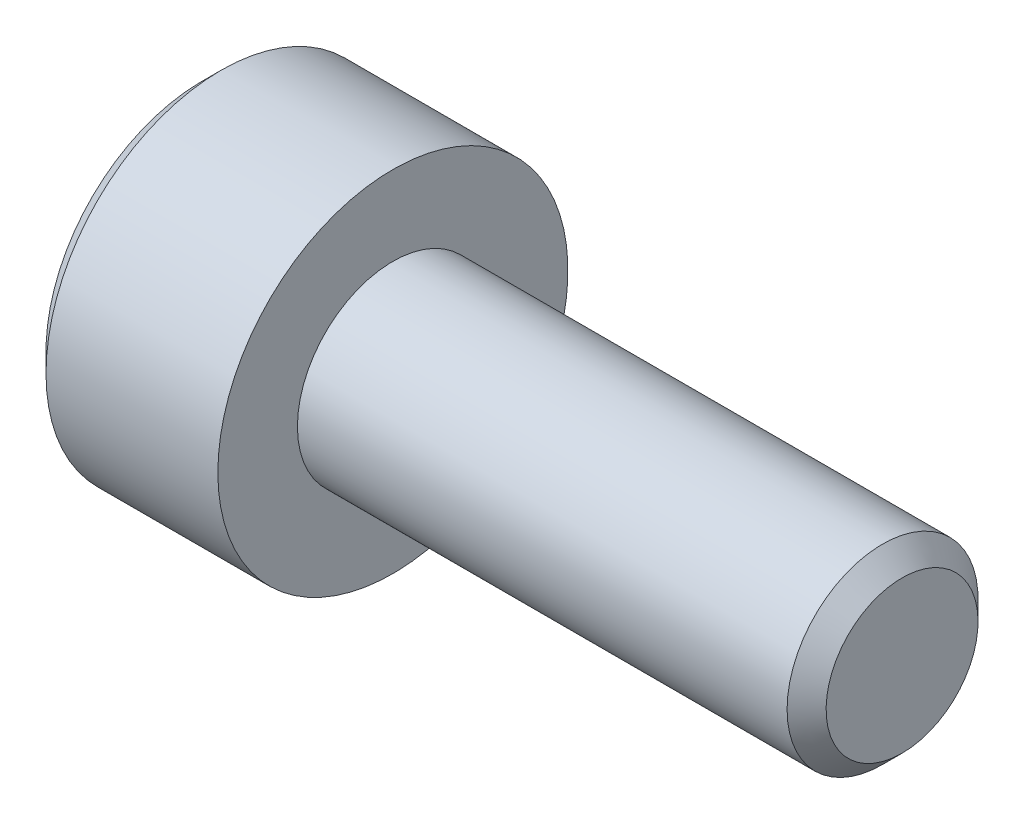
ISO-10303-21;
HEADER;
FILE_DESCRIPTION(('STEP AP214'),'2;1');
FILE_NAME('part.step','',(''),(''),'','','');
FILE_SCHEMA(('AUTOMOTIVE_DESIGN { 1 0 10303 214 1 1 1 1 }'));
ENDSEC;
DATA;
#1=APPLICATION_CONTEXT('core data for automotive mechanical design processes');
#2=APPLICATION_PROTOCOL_DEFINITION('international standard','automotive_design',2000,#1);
#3=PRODUCT_CONTEXT('',#1,'mechanical');
#4=PRODUCT('Part','Part','',(#3));
#5=PRODUCT_RELATED_PRODUCT_CATEGORY('part','',(#4));
#6=PRODUCT_DEFINITION_FORMATION('','',#4);
#7=PRODUCT_DEFINITION_CONTEXT('part definition',#1,'design');
#8=PRODUCT_DEFINITION('design','',#6,#7);
#9=PRODUCT_DEFINITION_SHAPE('','',#8);
#10=(LENGTH_UNIT() NAMED_UNIT(*) SI_UNIT(.MILLI.,.METRE.));
#11=(NAMED_UNIT(*) PLANE_ANGLE_UNIT() SI_UNIT($,.RADIAN.));
#12=(NAMED_UNIT(*) SI_UNIT($,.STERADIAN.) SOLID_ANGLE_UNIT());
#13=UNCERTAINTY_MEASURE_WITH_UNIT(LENGTH_MEASURE(1.E-05),#10,'distance_accuracy_value','');
#14=(GEOMETRIC_REPRESENTATION_CONTEXT(3) GLOBAL_UNCERTAINTY_ASSIGNED_CONTEXT((#13)) GLOBAL_UNIT_ASSIGNED_CONTEXT((#10,
#11,#12)) REPRESENTATION_CONTEXT('',''));
#15=CARTESIAN_POINT('',(0.,0.,0.));
#16=DIRECTION('',(0.,0.,1.));
#17=DIRECTION('',(1.,0.,0.));
#18=AXIS2_PLACEMENT_3D('',#15,#16,#17);
#19=CARTESIAN_POINT('',(-1.49999999999295,0.,0.));
#20=DIRECTION('',(-1.,0.,0.));
#21=DIRECTION('',(0.,0.,1.));
#22=AXIS2_PLACEMENT_3D('',#19,#20,#21);
#23=CONICAL_SURFACE('',#22,1.24999999997044,1.30899693901632);
#24=CARTESIAN_POINT('',(-1.16506350948953,0.,0.));
#25=VERTEX_POINT('',#24);
#26=VERTEX_LOOP('',#25);
#27=FACE_BOUND('',#26,.T.);
#28=CARTESIAN_POINT('',(-1.49999999999295,0.,0.));
#29=DIRECTION('',(-1.,0.,0.));
#30=DIRECTION('',(0.,0.,1.));
#31=AXIS2_PLACEMENT_3D('',#28,#29,#30);
#32=CIRCLE('',#31,1.24999999997044);
#33=CARTESIAN_POINT('',(-1.49999999999648,1.08253175471775,-0.624999999992609));
#34=VERTEX_POINT('',#33);
#35=CARTESIAN_POINT('',(-1.49999999999648,0.,-1.24999999998522));
#36=VERTEX_POINT('',#35);
#37=EDGE_CURVE('E152',#34,#36,#32,.T.);
#38=ORIENTED_EDGE('',*,*,#37,.T.);
#39=CARTESIAN_POINT('',(-1.49999999999295,0.,0.));
#40=DIRECTION('',(-1.,0.,0.));
#41=DIRECTION('',(0.,0.,1.));
#42=AXIS2_PLACEMENT_3D('',#39,#40,#41);
#43=CIRCLE('',#42,1.24999999997044);
#44=CARTESIAN_POINT('',(-1.49999999999648,-1.08253175471775,-0.624999999992609));
#45=VERTEX_POINT('',#44);
#46=EDGE_CURVE('E136',#36,#45,#43,.T.);
#47=ORIENTED_EDGE('',*,*,#46,.T.);
#48=CARTESIAN_POINT('',(-1.49999999999295,0.,0.));
#49=DIRECTION('',(-1.,0.,0.));
#50=DIRECTION('',(0.,0.,1.));
#51=AXIS2_PLACEMENT_3D('',#48,#49,#50);
#52=CIRCLE('',#51,1.24999999997044);
#53=CARTESIAN_POINT('',(-1.49999999999648,-1.08253175471775,0.624999999992609));
#54=VERTEX_POINT('',#53);
#55=EDGE_CURVE('E89',#45,#54,#52,.T.);
#56=ORIENTED_EDGE('',*,*,#55,.T.);
#57=CARTESIAN_POINT('',(-1.49999999999295,0.,0.));
#58=DIRECTION('',(-1.,0.,0.));
#59=DIRECTION('',(0.,0.,1.));
#60=AXIS2_PLACEMENT_3D('',#57,#58,#59);
#61=CIRCLE('',#60,1.24999999997044);
#62=CARTESIAN_POINT('',(-1.49999999999648,0.,1.24999999998522));
#63=VERTEX_POINT('',#62);
#64=EDGE_CURVE('E20',#54,#63,#61,.T.);
#65=ORIENTED_EDGE('',*,*,#64,.T.);
#66=CARTESIAN_POINT('',(-1.49999999999295,0.,0.));
#67=DIRECTION('',(-1.,0.,0.));
#68=DIRECTION('',(0.,0.,1.));
#69=AXIS2_PLACEMENT_3D('',#66,#67,#68);
#70=CIRCLE('',#69,1.24999999997044);
#71=CARTESIAN_POINT('',(-1.49999999999648,1.08253175471775,0.624999999992609));
#72=VERTEX_POINT('',#71);
#73=EDGE_CURVE('E92',#63,#72,#70,.T.);
#74=ORIENTED_EDGE('',*,*,#73,.T.);
#75=CARTESIAN_POINT('',(-1.49999999999295,0.,0.));
#76=DIRECTION('',(-1.,0.,0.));
#77=DIRECTION('',(0.,0.,1.));
#78=AXIS2_PLACEMENT_3D('',#75,#76,#77);
#79=CIRCLE('',#78,1.24999999997044);
#80=EDGE_CURVE('E106',#72,#34,#79,.T.);
#81=ORIENTED_EDGE('',*,*,#80,.T.);
#82=EDGE_LOOP('',(#38,#47,#56,#65,#74,#81));
#83=FACE_BOUND('',#82,.T.);
#84=ADVANCED_FACE('F17',(#27,#83),#23,.F.);
#85=CARTESIAN_POINT('',(-1.5,0.,0.));
#86=DIRECTION('',(1.,0.,0.));
#87=DIRECTION('',(0.,0.,-1.));
#88=AXIS2_PLACEMENT_3D('',#85,#86,#87);
#89=PLANE('',#88);
#90=DIRECTION('',(0.,0.5,0.866025403784439));
#91=VECTOR('',#90,1.);
#92=CARTESIAN_POINT('',(-1.5,-0.721687836487032,1.25));
#93=LINE('',#92,#91);
#94=CARTESIAN_POINT('',(-1.5,-0.721687836487032,1.25));
#95=VERTEX_POINT('',#94);
#96=EDGE_CURVE('E111',#95,#54,#93,.F.);
#97=ORIENTED_EDGE('',*,*,#96,.F.);
#98=DIRECTION('',(0.,1.,0.));
#99=VECTOR('',#98,1.);
#100=CARTESIAN_POINT('',(-1.5,0.721687836487032,1.25));
#101=LINE('',#100,#99);
#102=EDGE_CURVE('E108',#63,#95,#101,.F.);
#103=ORIENTED_EDGE('',*,*,#102,.F.);
#104=ORIENTED_EDGE('',*,*,#64,.F.);
#105=EDGE_LOOP('',(#97,#103,#104));
#106=FACE_BOUND('',#105,.T.);
#107=ADVANCED_FACE('F109',(#106),#89,.F.);
#108=CARTESIAN_POINT('',(-1.5,0.,0.));
#109=DIRECTION('',(1.,0.,0.));
#110=DIRECTION('',(0.,0.,-1.));
#111=AXIS2_PLACEMENT_3D('',#108,#109,#110);
#112=PLANE('',#111);
#113=DIRECTION('',(0.,1.,0.));
#114=VECTOR('',#113,1.);
#115=CARTESIAN_POINT('',(-1.5,0.721687836487032,1.25));
#116=LINE('',#115,#114);
#117=CARTESIAN_POINT('',(-1.5,0.721687836487029,1.25));
#118=VERTEX_POINT('',#117);
#119=EDGE_CURVE('E101',#118,#63,#116,.F.);
#120=ORIENTED_EDGE('',*,*,#119,.F.);
#121=DIRECTION('',(0.,0.5,-0.866025403784439));
#122=VECTOR('',#121,1.);
#123=CARTESIAN_POINT('',(-1.5,1.44337567297406,0.));
#124=LINE('',#123,#122);
#125=EDGE_CURVE('E104',#72,#118,#124,.F.);
#126=ORIENTED_EDGE('',*,*,#125,.F.);
#127=ORIENTED_EDGE('',*,*,#73,.F.);
#128=EDGE_LOOP('',(#120,#126,#127));
#129=FACE_BOUND('',#128,.T.);
#130=ADVANCED_FACE('F99',(#129),#112,.F.);
#131=CARTESIAN_POINT('',(-1.5,0.,0.));
#132=DIRECTION('',(1.,0.,0.));
#133=DIRECTION('',(0.,0.,-1.));
#134=AXIS2_PLACEMENT_3D('',#131,#132,#133);
#135=PLANE('',#134);
#136=ORIENTED_EDGE('',*,*,#80,.F.);
#137=DIRECTION('',(0.,0.5,-0.866025403784439));
#138=VECTOR('',#137,1.);
#139=CARTESIAN_POINT('',(-1.5,1.44337567297406,0.));
#140=LINE('',#139,#138);
#141=CARTESIAN_POINT('',(-1.5,1.44337567297406,0.));
#142=VERTEX_POINT('',#141);
#143=EDGE_CURVE('E132',#142,#72,#140,.F.);
#144=ORIENTED_EDGE('',*,*,#143,.F.);
#145=DIRECTION('',(0.,-0.5,-0.866025403784439));
#146=VECTOR('',#145,1.);
#147=CARTESIAN_POINT('',(-1.5,0.721687836487032,-1.25));
#148=LINE('',#147,#146);
#149=EDGE_CURVE('E168',#34,#142,#148,.F.);
#150=ORIENTED_EDGE('',*,*,#149,.F.);
#151=EDGE_LOOP('',(#136,#144,#150));
#152=FACE_BOUND('',#151,.T.);
#153=ADVANCED_FACE('F169',(#152),#135,.F.);
#154=CARTESIAN_POINT('',(-1.5,0.,0.));
#155=DIRECTION('',(1.,0.,0.));
#156=DIRECTION('',(0.,0.,-1.));
#157=AXIS2_PLACEMENT_3D('',#154,#155,#156);
#158=PLANE('',#157);
#159=DIRECTION('',(0.,-0.5,-0.866025403784439));
#160=VECTOR('',#159,1.);
#161=CARTESIAN_POINT('',(-1.5,0.721687836487032,-1.25));
#162=LINE('',#161,#160);
#163=CARTESIAN_POINT('',(-1.5,0.721687836487032,-1.25));
#164=VERTEX_POINT('',#163);
#165=EDGE_CURVE('E162',#164,#34,#162,.F.);
#166=ORIENTED_EDGE('',*,*,#165,.F.);
#167=DIRECTION('',(0.,1.,0.));
#168=VECTOR('',#167,1.);
#169=CARTESIAN_POINT('',(-1.5,-0.721687836487032,-1.25));
#170=LINE('',#169,#168);
#171=EDGE_CURVE('E165',#36,#164,#170,.T.);
#172=ORIENTED_EDGE('',*,*,#171,.F.);
#173=ORIENTED_EDGE('',*,*,#37,.F.);
#174=EDGE_LOOP('',(#166,#172,#173));
#175=FACE_BOUND('',#174,.T.);
#176=ADVANCED_FACE('F160',(#175),#158,.F.);
#177=CARTESIAN_POINT('',(-1.5,0.,0.));
#178=DIRECTION('',(1.,0.,0.));
#179=DIRECTION('',(0.,0.,-1.));
#180=AXIS2_PLACEMENT_3D('',#177,#178,#179);
#181=PLANE('',#180);
#182=DIRECTION('',(0.,-0.5,0.866025403784439));
#183=VECTOR('',#182,1.);
#184=CARTESIAN_POINT('',(-1.5,-1.44337567297406,0.));
#185=LINE('',#184,#183);
#186=CARTESIAN_POINT('',(-1.5,-1.44337567297406,0.));
#187=VERTEX_POINT('',#186);
#188=EDGE_CURVE('E214',#187,#45,#185,.F.);
#189=ORIENTED_EDGE('',*,*,#188,.F.);
#190=DIRECTION('',(0.,0.5,0.866025403784439));
#191=VECTOR('',#190,1.);
#192=CARTESIAN_POINT('',(-1.5,-0.721687836487032,1.25));
#193=LINE('',#192,#191);
#194=EDGE_CURVE('E120',#54,#187,#193,.F.);
#195=ORIENTED_EDGE('',*,*,#194,.F.);
#196=ORIENTED_EDGE('',*,*,#55,.F.);
#197=EDGE_LOOP('',(#189,#195,#196));
#198=FACE_BOUND('',#197,.T.);
#199=ADVANCED_FACE('F253',(#198),#181,.F.);
#200=CARTESIAN_POINT('',(-1.5,0.,0.));
#201=DIRECTION('',(1.,0.,0.));
#202=DIRECTION('',(0.,0.,-1.));
#203=AXIS2_PLACEMENT_3D('',#200,#201,#202);
#204=PLANE('',#203);
#205=DIRECTION('',(0.,1.,0.));
#206=VECTOR('',#205,1.);
#207=CARTESIAN_POINT('',(-1.5,-0.721687836487032,-1.25));
#208=LINE('',#207,#206);
#209=CARTESIAN_POINT('',(-1.5,-0.721687836487029,-1.25));
#210=VERTEX_POINT('',#209);
#211=EDGE_CURVE('E187',#210,#36,#208,.T.);
#212=ORIENTED_EDGE('',*,*,#211,.F.);
#213=DIRECTION('',(0.,-0.5,0.866025403784439));
#214=VECTOR('',#213,1.);
#215=CARTESIAN_POINT('',(-1.5,-1.44337567297406,0.));
#216=LINE('',#215,#214);
#217=EDGE_CURVE('E217',#45,#210,#216,.F.);
#218=ORIENTED_EDGE('',*,*,#217,.F.);
#219=ORIENTED_EDGE('',*,*,#46,.F.);
#220=EDGE_LOOP('',(#212,#218,#219));
#221=FACE_BOUND('',#220,.T.);
#222=ADVANCED_FACE('F250',(#221),#204,.F.);
#223=CARTESIAN_POINT('',(-1.5,-0.721687836487032,1.25));
#224=DIRECTION('',(0.,0.866025403784439,-0.5));
#225=DIRECTION('',(0.,0.5,0.866025403784439));
#226=AXIS2_PLACEMENT_3D('',#223,#224,#225);
#227=PLANE('',#226);
#228=ORIENTED_EDGE('',*,*,#194,.T.);
#229=DIRECTION('',(1.,0.,0.));
#230=VECTOR('',#229,1.);
#231=CARTESIAN_POINT('',(-1.5,-1.44337567297406,0.));
#232=LINE('',#231,#230);
#233=CARTESIAN_POINT('',(-3.,-1.44337567297406,0.));
#234=VERTEX_POINT('',#233);
#235=EDGE_CURVE('E218',#234,#187,#232,.T.);
#236=ORIENTED_EDGE('',*,*,#235,.F.);
#237=DIRECTION('',(0.,0.499999999999998,0.86602540378444));
#238=VECTOR('',#237,1.);
#239=CARTESIAN_POINT('',(-3.,-1.44337567297406,0.));
#240=LINE('',#239,#238);
#241=CARTESIAN_POINT('',(-3.,-0.721687836487032,1.25));
#242=VERTEX_POINT('',#241);
#243=EDGE_CURVE('E213',#234,#242,#240,.T.);
#244=ORIENTED_EDGE('',*,*,#243,.T.);
#245=DIRECTION('',(-1.,0.,0.));
#246=VECTOR('',#245,1.);
#247=CARTESIAN_POINT('',(-1.5,-0.721687836487032,1.25));
#248=LINE('',#247,#246);
#249=EDGE_CURVE('E115',#95,#242,#248,.T.);
#250=ORIENTED_EDGE('',*,*,#249,.F.);
#251=ORIENTED_EDGE('',*,*,#96,.T.);
#252=EDGE_LOOP('',(#228,#236,#244,#250,#251));
#253=FACE_BOUND('',#252,.T.);
#254=ADVANCED_FACE('F255',(#253),#227,.T.);
#255=CARTESIAN_POINT('',(-1.5,0.721687836487032,1.25));
#256=DIRECTION('',(0.,0.,-1.));
#257=DIRECTION('',(-1.,0.,0.));
#258=AXIS2_PLACEMENT_3D('',#255,#256,#257);
#259=PLANE('',#258);
#260=ORIENTED_EDGE('',*,*,#102,.T.);
#261=ORIENTED_EDGE('',*,*,#249,.T.);
#262=DIRECTION('',(0.,1.,0.));
#263=VECTOR('',#262,1.);
#264=CARTESIAN_POINT('',(-3.,0.,1.25));
#265=LINE('',#264,#263);
#266=CARTESIAN_POINT('',(-3.,0.721687836487031,1.25));
#267=VERTEX_POINT('',#266);
#268=EDGE_CURVE('E208',#242,#267,#265,.T.);
#269=ORIENTED_EDGE('',*,*,#268,.T.);
#270=DIRECTION('',(1.,0.,0.));
#271=VECTOR('',#270,1.);
#272=CARTESIAN_POINT('',(-1.5,0.721687836487029,1.25));
#273=LINE('',#272,#271);
#274=EDGE_CURVE('E119',#118,#267,#273,.F.);
#275=ORIENTED_EDGE('',*,*,#274,.F.);
#276=ORIENTED_EDGE('',*,*,#119,.T.);
#277=EDGE_LOOP('',(#260,#261,#269,#275,#276));
#278=FACE_BOUND('',#277,.T.);
#279=ADVANCED_FACE('F117',(#278),#259,.T.);
#280=CARTESIAN_POINT('',(-1.5,1.44337567297406,0.));
#281=DIRECTION('',(0.,-0.866025403784439,-0.5));
#282=DIRECTION('',(0.,0.5,-0.866025403784439));
#283=AXIS2_PLACEMENT_3D('',#280,#281,#282);
#284=PLANE('',#283);
#285=ORIENTED_EDGE('',*,*,#125,.T.);
#286=ORIENTED_EDGE('',*,*,#274,.T.);
#287=DIRECTION('',(0.,0.499999999999998,-0.86602540378444));
#288=VECTOR('',#287,1.);
#289=CARTESIAN_POINT('',(-3.,0.721687836487032,1.25));
#290=LINE('',#289,#288);
#291=CARTESIAN_POINT('',(-3.,1.44337567297406,0.));
#292=VERTEX_POINT('',#291);
#293=EDGE_CURVE('E198',#267,#292,#290,.T.);
#294=ORIENTED_EDGE('',*,*,#293,.T.);
#295=DIRECTION('',(1.,0.,0.));
#296=VECTOR('',#295,1.);
#297=CARTESIAN_POINT('',(-1.5,1.44337567297406,0.));
#298=LINE('',#297,#296);
#299=EDGE_CURVE('E173',#142,#292,#298,.F.);
#300=ORIENTED_EDGE('',*,*,#299,.F.);
#301=ORIENTED_EDGE('',*,*,#143,.T.);
#302=EDGE_LOOP('',(#285,#286,#294,#300,#301));
#303=FACE_BOUND('',#302,.T.);
#304=ADVANCED_FACE('F196',(#303),#284,.T.);
#305=CARTESIAN_POINT('',(-1.5,0.721687836487032,-1.25));
#306=DIRECTION('',(0.,-0.866025403784439,0.5));
#307=DIRECTION('',(0.,-0.5,-0.866025403784439));
#308=AXIS2_PLACEMENT_3D('',#305,#306,#307);
#309=PLANE('',#308);
#310=ORIENTED_EDGE('',*,*,#149,.T.);
#311=ORIENTED_EDGE('',*,*,#299,.T.);
#312=DIRECTION('',(0.,-0.499999999999998,-0.86602540378444));
#313=VECTOR('',#312,1.);
#314=CARTESIAN_POINT('',(-3.,1.44337567297406,0.));
#315=LINE('',#314,#313);
#316=CARTESIAN_POINT('',(-3.,0.721687836487032,-1.25));
#317=VERTEX_POINT('',#316);
#318=EDGE_CURVE('E200',#292,#317,#315,.T.);
#319=ORIENTED_EDGE('',*,*,#318,.T.);
#320=DIRECTION('',(1.,0.,0.));
#321=VECTOR('',#320,1.);
#322=CARTESIAN_POINT('',(-1.5,0.721687836487032,-1.25));
#323=LINE('',#322,#321);
#324=EDGE_CURVE('E176',#164,#317,#323,.F.);
#325=ORIENTED_EDGE('',*,*,#324,.F.);
#326=ORIENTED_EDGE('',*,*,#165,.T.);
#327=EDGE_LOOP('',(#310,#311,#319,#325,#326));
#328=FACE_BOUND('',#327,.T.);
#329=ADVANCED_FACE('F175',(#328),#309,.T.);
#330=CARTESIAN_POINT('',(-1.5,-0.721687836487032,-1.25));
#331=DIRECTION('',(0.,0.,1.));
#332=DIRECTION('',(1.,0.,0.));
#333=AXIS2_PLACEMENT_3D('',#330,#331,#332);
#334=PLANE('',#333);
#335=ORIENTED_EDGE('',*,*,#171,.T.);
#336=ORIENTED_EDGE('',*,*,#324,.T.);
#337=DIRECTION('',(0.,1.,0.));
#338=VECTOR('',#337,1.);
#339=CARTESIAN_POINT('',(-3.,0.,-1.25));
#340=LINE('',#339,#338);
#341=CARTESIAN_POINT('',(-3.,-0.721687836487031,-1.25));
#342=VERTEX_POINT('',#341);
#343=EDGE_CURVE('E35',#317,#342,#340,.F.);
#344=ORIENTED_EDGE('',*,*,#343,.T.);
#345=DIRECTION('',(1.,0.,0.));
#346=VECTOR('',#345,1.);
#347=CARTESIAN_POINT('',(-1.5,-0.721687836487029,-1.25));
#348=LINE('',#347,#346);
#349=EDGE_CURVE('E223',#210,#342,#348,.F.);
#350=ORIENTED_EDGE('',*,*,#349,.F.);
#351=ORIENTED_EDGE('',*,*,#211,.T.);
#352=EDGE_LOOP('',(#335,#336,#344,#350,#351));
#353=FACE_BOUND('',#352,.T.);
#354=ADVANCED_FACE('F247',(#353),#334,.T.);
#355=CARTESIAN_POINT('',(-1.5,-1.44337567297406,0.));
#356=DIRECTION('',(0.,0.866025403784439,0.5));
#357=DIRECTION('',(0.,-0.5,0.866025403784439));
#358=AXIS2_PLACEMENT_3D('',#355,#356,#357);
#359=PLANE('',#358);
#360=ORIENTED_EDGE('',*,*,#217,.T.);
#361=ORIENTED_EDGE('',*,*,#349,.T.);
#362=DIRECTION('',(0.,-0.499999999999998,0.86602540378444));
#363=VECTOR('',#362,1.);
#364=CARTESIAN_POINT('',(-3.,-0.721687836487032,-1.25));
#365=LINE('',#364,#363);
#366=EDGE_CURVE('E149',#342,#234,#365,.T.);
#367=ORIENTED_EDGE('',*,*,#366,.T.);
#368=ORIENTED_EDGE('',*,*,#235,.T.);
#369=ORIENTED_EDGE('',*,*,#188,.T.);
#370=EDGE_LOOP('',(#360,#361,#367,#368,#369));
#371=FACE_BOUND('',#370,.T.);
#372=ADVANCED_FACE('F258',(#371),#359,.T.);
#373=CARTESIAN_POINT('',(-3.,0.,0.));
#374=DIRECTION('',(1.,0.,0.));
#375=DIRECTION('',(0.,0.,-1.));
#376=AXIS2_PLACEMENT_3D('',#373,#374,#375);
#377=PLANE('',#376);
#378=ORIENTED_EDGE('',*,*,#343,.F.);
#379=ORIENTED_EDGE('',*,*,#318,.F.);
#380=ORIENTED_EDGE('',*,*,#293,.F.);
#381=ORIENTED_EDGE('',*,*,#268,.F.);
#382=ORIENTED_EDGE('',*,*,#243,.F.);
#383=ORIENTED_EDGE('',*,*,#366,.F.);
#384=EDGE_LOOP('',(#378,#379,#380,#381,#382,#383));
#385=FACE_BOUND('',#384,.T.);
#386=CARTESIAN_POINT('',(-2.9999999999859,0.,0.));
#387=DIRECTION('',(1.,0.,0.));
#388=DIRECTION('',(0.,0.,-1.));
#389=AXIS2_PLACEMENT_3D('',#386,#387,#388);
#390=CIRCLE('',#389,2.45000000006712);
#391=CARTESIAN_POINT('',(-2.9999999999859,0.,-2.45000000006712));
#392=VERTEX_POINT('',#391);
#393=EDGE_CURVE('E146',#392,#392,#390,.T.);
#394=ORIENTED_EDGE('',*,*,#393,.F.);
#395=EDGE_LOOP('',(#394));
#396=FACE_BOUND('',#395,.T.);
#397=ADVANCED_FACE('F202',(#385,#396),#377,.F.);
#398=CARTESIAN_POINT('',(-2.70000000000437,0.,0.));
#399=DIRECTION('',(1.,0.,0.));
#400=DIRECTION('',(0.,0.,-1.));
#401=AXIS2_PLACEMENT_3D('',#398,#399,#400);
#402=CONICAL_SURFACE('',#401,2.75000000004866,0.785398163397448);
#403=ORIENTED_EDGE('',*,*,#393,.T.);
#404=EDGE_LOOP('',(#403));
#405=FACE_BOUND('',#404,.T.);
#406=CARTESIAN_POINT('',(-2.7,0.,0.));
#407=DIRECTION('',(-1.,0.,0.));
#408=DIRECTION('',(0.,0.,1.));
#409=AXIS2_PLACEMENT_3D('',#406,#407,#408);
#410=CIRCLE('',#409,2.75);
#411=CARTESIAN_POINT('',(-2.7,0.,2.75));
#412=VERTEX_POINT('',#411);
#413=EDGE_CURVE('E145',#412,#412,#410,.F.);
#414=ORIENTED_EDGE('',*,*,#413,.F.);
#415=EDGE_LOOP('',(#414));
#416=FACE_BOUND('',#415,.T.);
#417=ADVANCED_FACE('F266',(#405,#416),#402,.T.);
#418=CARTESIAN_POINT('',(8.,1.1935,0.));
#419=DIRECTION('',(-1.,0.,0.));
#420=DIRECTION('',(0.,0.,1.));
#421=AXIS2_PLACEMENT_3D('',#418,#419,#420);
#422=PLANE('',#421);
#423=CARTESIAN_POINT('',(8.0000000000382,0.,0.));
#424=DIRECTION('',(-1.,0.,0.));
#425=DIRECTION('',(0.,-1.,0.));
#426=AXIS2_PLACEMENT_3D('',#423,#424,#425);
#427=CIRCLE('',#426,1.1934999999994);
#428=CARTESIAN_POINT('',(8.0000000000382,-1.1934999999994,0.));
#429=VERTEX_POINT('',#428);
#430=EDGE_CURVE('E142',#429,#429,#427,.T.);
#431=ORIENTED_EDGE('',*,*,#430,.F.);
#432=EDGE_LOOP('',(#431));
#433=FACE_BOUND('',#432,.T.);
#434=ADVANCED_FACE('F288',(#433),#422,.F.);
#435=CARTESIAN_POINT('',(8.,0.,0.));
#436=DIRECTION('',(-1.,0.,0.));
#437=DIRECTION('',(0.,0.,1.));
#438=AXIS2_PLACEMENT_3D('',#435,#436,#437);
#439=CYLINDRICAL_SURFACE('',#438,2.75);
#440=ORIENTED_EDGE('',*,*,#413,.T.);
#441=EDGE_LOOP('',(#440));
#442=FACE_BOUND('',#441,.T.);
#443=CARTESIAN_POINT('',(0.,0.,0.));
#444=DIRECTION('',(-1.,0.,0.));
#445=DIRECTION('',(0.,0.,1.));
#446=AXIS2_PLACEMENT_3D('',#443,#444,#445);
#447=CIRCLE('',#446,2.75);
#448=CARTESIAN_POINT('',(0.,0.,2.75));
#449=VERTEX_POINT('',#448);
#450=EDGE_CURVE('E139',#449,#449,#447,.T.);
#451=ORIENTED_EDGE('',*,*,#450,.T.);
#452=EDGE_LOOP('',(#451));
#453=FACE_BOUND('',#452,.T.);
#454=ADVANCED_FACE('F284',(#442,#453),#439,.T.);
#455=CARTESIAN_POINT('',(7.69349999990254,0.,0.));
#456=DIRECTION('',(-1.,0.,0.));
#457=DIRECTION('',(0.,-1.,0.));
#458=AXIS2_PLACEMENT_3D('',#455,#456,#457);
#459=CONICAL_SURFACE('',#458,1.50000000007822,0.785398163304718);
#460=CARTESIAN_POINT('',(7.6935,0.,0.));
#461=DIRECTION('',(-1.,0.,0.));
#462=DIRECTION('',(0.,0.,1.));
#463=AXIS2_PLACEMENT_3D('',#460,#461,#462);
#464=CIRCLE('',#463,1.5);
#465=CARTESIAN_POINT('',(7.6935,0.,1.5));
#466=VERTEX_POINT('',#465);
#467=EDGE_CURVE('E26',#466,#466,#464,.T.);
#468=ORIENTED_EDGE('',*,*,#467,.F.);
#469=EDGE_LOOP('',(#468));
#470=FACE_BOUND('',#469,.T.);
#471=ORIENTED_EDGE('',*,*,#430,.T.);
#472=EDGE_LOOP('',(#471));
#473=FACE_BOUND('',#472,.T.);
#474=ADVANCED_FACE('F277',(#470,#473),#459,.T.);
#475=CARTESIAN_POINT('',(0.,2.75,0.));
#476=DIRECTION('',(-1.,0.,0.));
#477=DIRECTION('',(0.,0.,1.));
#478=AXIS2_PLACEMENT_3D('',#475,#476,#477);
#479=PLANE('',#478);
#480=ORIENTED_EDGE('',*,*,#450,.F.);
#481=EDGE_LOOP('',(#480));
#482=FACE_BOUND('',#481,.T.);
#483=CARTESIAN_POINT('',(0.,0.,0.));
#484=DIRECTION('',(-1.,0.,0.));
#485=DIRECTION('',(0.,0.,1.));
#486=AXIS2_PLACEMENT_3D('',#483,#484,#485);
#487=CIRCLE('',#486,1.5);
#488=CARTESIAN_POINT('',(0.,0.,1.5));
#489=VERTEX_POINT('',#488);
#490=EDGE_CURVE('E11',#489,#489,#487,.F.);
#491=ORIENTED_EDGE('',*,*,#490,.F.);
#492=EDGE_LOOP('',(#491));
#493=FACE_BOUND('',#492,.T.);
#494=ADVANCED_FACE('F271',(#482,#493),#479,.F.);
#495=CARTESIAN_POINT('',(8.,0.,0.));
#496=DIRECTION('',(-1.,0.,0.));
#497=DIRECTION('',(0.,0.,1.));
#498=AXIS2_PLACEMENT_3D('',#495,#496,#497);
#499=CYLINDRICAL_SURFACE('',#498,1.5);
#500=ORIENTED_EDGE('',*,*,#490,.T.);
#501=EDGE_LOOP('',(#500));
#502=FACE_BOUND('',#501,.T.);
#503=ORIENTED_EDGE('',*,*,#467,.T.);
#504=EDGE_LOOP('',(#503));
#505=FACE_BOUND('',#504,.T.);
#506=ADVANCED_FACE('F269',(#502,#505),#499,.T.);
#507=CLOSED_SHELL('',(#84,#107,#130,#153,#176,#199,#222,#254,#279,#304,#329,#354,#372,#397,#417,
#434,#454,#474,#494,#506));
#508=MANIFOLD_SOLID_BREP('B1',#507);
#509=ADVANCED_BREP_SHAPE_REPRESENTATION('',(#18,#508),#14);
#510=SHAPE_DEFINITION_REPRESENTATION(#9,#509);
ENDSEC;
END-ISO-10303-21;
